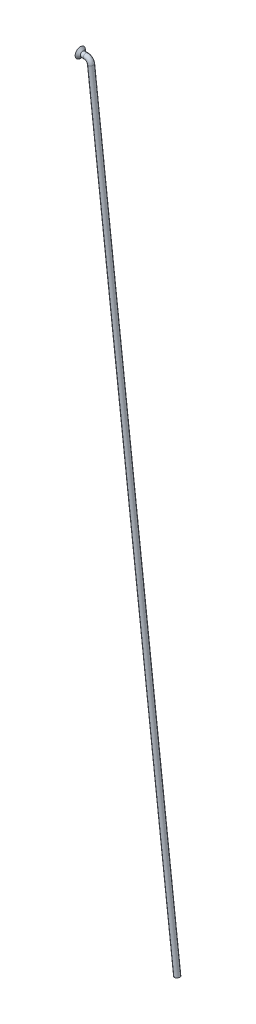
ISO-10303-21;
HEADER;
FILE_DESCRIPTION(('STEP AP214'),'2;1');
FILE_NAME('part.step','',(''),(''),'','','');
FILE_SCHEMA(('AUTOMOTIVE_DESIGN { 1 0 10303 214 1 1 1 1 }'));
ENDSEC;
DATA;
#1=APPLICATION_CONTEXT('core data for automotive mechanical design processes');
#2=APPLICATION_PROTOCOL_DEFINITION('international standard','automotive_design',2000,#1);
#3=PRODUCT_CONTEXT('',#1,'mechanical');
#4=PRODUCT('Part','Part','',(#3));
#5=PRODUCT_RELATED_PRODUCT_CATEGORY('part','',(#4));
#6=PRODUCT_DEFINITION_FORMATION('','',#4);
#7=PRODUCT_DEFINITION_CONTEXT('part definition',#1,'design');
#8=PRODUCT_DEFINITION('design','',#6,#7);
#9=PRODUCT_DEFINITION_SHAPE('','',#8);
#10=(LENGTH_UNIT() NAMED_UNIT(*) SI_UNIT(.MILLI.,.METRE.));
#11=(NAMED_UNIT(*) PLANE_ANGLE_UNIT() SI_UNIT($,.RADIAN.));
#12=(NAMED_UNIT(*) SI_UNIT($,.STERADIAN.) SOLID_ANGLE_UNIT());
#13=UNCERTAINTY_MEASURE_WITH_UNIT(LENGTH_MEASURE(1.E-05),#10,'distance_accuracy_value','');
#14=(GEOMETRIC_REPRESENTATION_CONTEXT(3) GLOBAL_UNCERTAINTY_ASSIGNED_CONTEXT((#13)) GLOBAL_UNIT_ASSIGNED_CONTEXT((#10,
#11,#12)) REPRESENTATION_CONTEXT('',''));
#15=CARTESIAN_POINT('',(0.,0.,0.));
#16=DIRECTION('',(0.,0.,1.));
#17=DIRECTION('',(1.,0.,0.));
#18=AXIS2_PLACEMENT_3D('',#15,#16,#17);
#19=CARTESIAN_POINT('',(0.204264391711603,-1.7708192180233,0.));
#20=DIRECTION('',(0.114590390988353,-0.993412825714034,0.));
#21=DIRECTION('',(0.993412825714031,0.114590390988353,0.));
#22=AXIS2_PLACEMENT_3D('',#19,#20,#21);
#23=CYLINDRICAL_SURFACE('',#22,0.999999999999998);
#24=CARTESIAN_POINT('',(0.204264391711603,-1.7708192180233,0.));
#25=DIRECTION('',(0.114590390988353,-0.993412825714034,0.));
#26=DIRECTION('',(0.,0.,-1.));
#27=AXIS2_PLACEMENT_3D('',#24,#25,#26);
#28=CIRCLE('',#27,0.999999999999998);
#29=CARTESIAN_POINT('',(1.19767721742564,-1.65622882703495,0.));
#30=VERTEX_POINT('',#29);
#31=EDGE_CURVE('E35',#30,#30,#28,.T.);
#32=ORIENTED_EDGE('',*,*,#31,.T.);
#33=EDGE_LOOP('',(#32));
#34=FACE_BOUND('',#33,.T.);
#35=CARTESIAN_POINT('',(33.8041653415642,-293.05678358564,0.));
#36=DIRECTION('',(0.114590390988353,-0.993412825714034,0.));
#37=DIRECTION('',(0.,0.,-1.));
#38=AXIS2_PLACEMENT_3D('',#35,#36,#37);
#39=CIRCLE('',#38,0.999999999999998);
#40=CARTESIAN_POINT('',(33.8041653415642,-293.05678358564,-0.99999999999999));
#41=VERTEX_POINT('',#40);
#42=EDGE_CURVE('E10',#41,#41,#39,.T.);
#43=ORIENTED_EDGE('',*,*,#42,.F.);
#44=EDGE_LOOP('',(#43));
#45=FACE_BOUND('',#44,.T.);
#46=ADVANCED_FACE('F29',(#34,#45),#23,.T.);
#47=CARTESIAN_POINT('',(-1.78256125971646,-1.99999999999999,0.));
#48=DIRECTION('',(0.,0.,-1.));
#49=DIRECTION('',(-1.,0.,0.));
#50=AXIS2_PLACEMENT_3D('',#47,#48,#49);
#51=TOROIDAL_SURFACE('',#50,2.,0.999999999999998);
#52=CARTESIAN_POINT('',(-1.78256125971646,0.,0.));
#53=DIRECTION('',(1.,0.,0.));
#54=DIRECTION('',(0.,0.,-1.));
#55=AXIS2_PLACEMENT_3D('',#52,#53,#54);
#56=CIRCLE('',#55,0.999999999999998);
#57=CARTESIAN_POINT('',(-1.78256125971646,1.00000000000001,0.));
#58=VERTEX_POINT('',#57);
#59=EDGE_CURVE('E39',#58,#58,#56,.T.);
#60=CARTESIAN_POINT('',(-1.78256125971646,-1.99999999999999,0.));
#61=DIRECTION('',(0.,0.,-1.));
#62=DIRECTION('',(-1.,0.,0.));
#63=AXIS2_PLACEMENT_3D('',#60,#61,#62);
#64=CIRCLE('',#63,3.);
#65=EDGE_CURVE('',#58,#30,#64,.T.);
#66=ORIENTED_EDGE('',*,*,#59,.T.);
#67=ORIENTED_EDGE('',*,*,#31,.F.);
#68=ORIENTED_EDGE('',*,*,#65,.T.);
#69=ORIENTED_EDGE('',*,*,#65,.F.);
#70=EDGE_LOOP('',(#66,#68,#67,#69));
#71=FACE_BOUND('',#70,.T.);
#72=ADVANCED_FACE('F70',(#71),#51,.T.);
#73=CARTESIAN_POINT('',(-1.78256125971646,0.,0.));
#74=DIRECTION('',(-1.,0.,0.));
#75=DIRECTION('',(0.,-1.,0.));
#76=AXIS2_PLACEMENT_3D('',#73,#74,#75);
#77=CYLINDRICAL_SURFACE('',#76,0.999999999999998);
#78=CARTESIAN_POINT('',(-3.,0.,0.));
#79=DIRECTION('',(1.,0.,0.));
#80=DIRECTION('',(0.,1.,0.));
#81=AXIS2_PLACEMENT_3D('',#78,#79,#80);
#82=CIRCLE('',#81,0.999999999999999);
#83=CARTESIAN_POINT('',(-3.,1.00000000000001,0.));
#84=VERTEX_POINT('',#83);
#85=EDGE_CURVE('E48',#84,#84,#82,.T.);
#86=ORIENTED_EDGE('',*,*,#85,.T.);
#87=EDGE_LOOP('',(#86));
#88=FACE_BOUND('',#87,.T.);
#89=ORIENTED_EDGE('',*,*,#59,.F.);
#90=EDGE_LOOP('',(#89));
#91=FACE_BOUND('',#90,.T.);
#92=ADVANCED_FACE('F52',(#88,#91),#77,.T.);
#93=CARTESIAN_POINT('',(33.8041653415642,-293.05678358564,0.));
#94=DIRECTION('',(0.114590390988353,-0.993412825714034,0.));
#95=DIRECTION('',(0.,0.,-1.));
#96=AXIS2_PLACEMENT_3D('',#93,#94,#95);
#97=PLANE('',#96);
#98=ORIENTED_EDGE('',*,*,#42,.T.);
#99=EDGE_LOOP('',(#98));
#100=FACE_BOUND('',#99,.T.);
#101=ADVANCED_FACE('F58',(#100),#97,.T.);
#102=CARTESIAN_POINT('',(-3.,0.,0.));
#103=DIRECTION('',(-1.,0.,0.));
#104=DIRECTION('',(0.,-1.,0.));
#105=AXIS2_PLACEMENT_3D('',#102,#103,#104);
#106=CONICAL_SURFACE('',#105,0.999999999999999,0.785398163397449);
#107=CARTESIAN_POINT('',(-4.,0.,0.));
#108=DIRECTION('',(1.,0.,0.));
#109=DIRECTION('',(0.,1.,0.));
#110=AXIS2_PLACEMENT_3D('',#107,#108,#109);
#111=CIRCLE('',#110,2.);
#112=CARTESIAN_POINT('',(-4.,2.,0.));
#113=VERTEX_POINT('',#112);
#114=EDGE_CURVE('E43',#113,#113,#111,.T.);
#115=ORIENTED_EDGE('',*,*,#114,.T.);
#116=EDGE_LOOP('',(#115));
#117=FACE_BOUND('',#116,.T.);
#118=ORIENTED_EDGE('',*,*,#85,.F.);
#119=EDGE_LOOP('',(#118));
#120=FACE_BOUND('',#119,.T.);
#121=ADVANCED_FACE('F55',(#117,#120),#106,.T.);
#122=CARTESIAN_POINT('',(-4.,0.,0.));
#123=DIRECTION('',(1.,0.,0.));
#124=DIRECTION('',(0.,0.,-1.));
#125=AXIS2_PLACEMENT_3D('',#122,#123,#124);
#126=PLANE('',#125);
#127=ORIENTED_EDGE('',*,*,#114,.F.);
#128=EDGE_LOOP('',(#127));
#129=FACE_BOUND('',#128,.T.);
#130=ADVANCED_FACE('F57',(#129),#126,.F.);
#131=CLOSED_SHELL('',(#46,#72,#92,#101,#121,#130));
#132=MANIFOLD_SOLID_BREP('B2',#131);
#133=ADVANCED_BREP_SHAPE_REPRESENTATION('',(#18,#132),#14);
#134=SHAPE_DEFINITION_REPRESENTATION(#9,#133);
ENDSEC;
END-ISO-10303-21;
